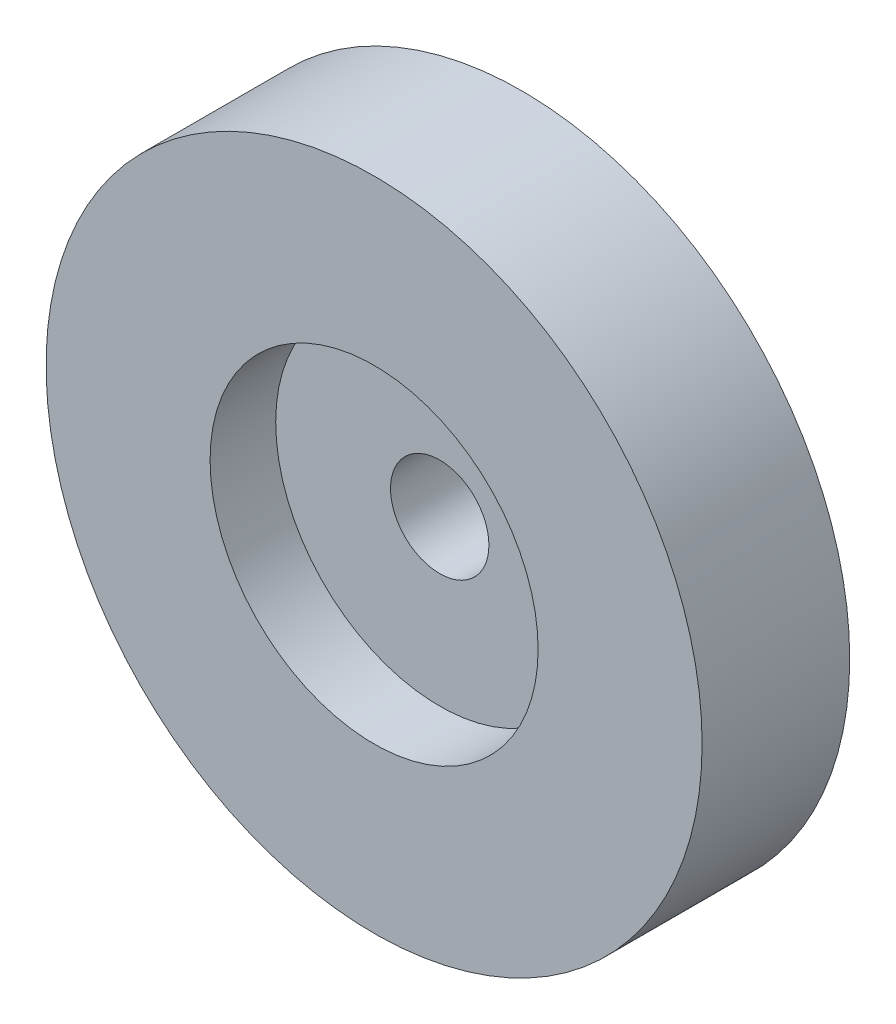
ISO-10303-21;
HEADER;
FILE_DESCRIPTION(('STEP AP214'),'2;1');
FILE_NAME('part.step','',(''),(''),'','','');
FILE_SCHEMA(('AUTOMOTIVE_DESIGN { 1 0 10303 214 1 1 1 1 }'));
ENDSEC;
DATA;
#1=APPLICATION_CONTEXT('core data for automotive mechanical design processes');
#2=APPLICATION_PROTOCOL_DEFINITION('international standard','automotive_design',2000,#1);
#3=PRODUCT_CONTEXT('',#1,'mechanical');
#4=PRODUCT('Part','Part','',(#3));
#5=PRODUCT_RELATED_PRODUCT_CATEGORY('part','',(#4));
#6=PRODUCT_DEFINITION_FORMATION('','',#4);
#7=PRODUCT_DEFINITION_CONTEXT('part definition',#1,'design');
#8=PRODUCT_DEFINITION('design','',#6,#7);
#9=PRODUCT_DEFINITION_SHAPE('','',#8);
#10=(LENGTH_UNIT() NAMED_UNIT(*) SI_UNIT(.MILLI.,.METRE.));
#11=(NAMED_UNIT(*) PLANE_ANGLE_UNIT() SI_UNIT($,.RADIAN.));
#12=(NAMED_UNIT(*) SI_UNIT($,.STERADIAN.) SOLID_ANGLE_UNIT());
#13=UNCERTAINTY_MEASURE_WITH_UNIT(LENGTH_MEASURE(1.E-05),#10,'distance_accuracy_value','');
#14=(GEOMETRIC_REPRESENTATION_CONTEXT(3) GLOBAL_UNCERTAINTY_ASSIGNED_CONTEXT((#13)) GLOBAL_UNIT_ASSIGNED_CONTEXT((#10,
#11,#12)) REPRESENTATION_CONTEXT('',''));
#15=CARTESIAN_POINT('',(0.,0.,0.));
#16=DIRECTION('',(0.,0.,1.));
#17=DIRECTION('',(1.,0.,0.));
#18=AXIS2_PLACEMENT_3D('',#15,#16,#17);
#19=CARTESIAN_POINT('',(0.,0.,0.));
#20=DIRECTION('',(0.,0.,1.));
#21=DIRECTION('',(1.,0.,0.));
#22=AXIS2_PLACEMENT_3D('',#19,#20,#21);
#23=CYLINDRICAL_SURFACE('',#22,6.);
#24=CARTESIAN_POINT('',(0.,0.,-18.));
#25=DIRECTION('',(0.,0.,1.));
#26=DIRECTION('',(1.,0.,0.));
#27=AXIS2_PLACEMENT_3D('',#24,#25,#26);
#28=CIRCLE('',#27,6.);
#29=CARTESIAN_POINT('',(6.,0.,-18.));
#30=VERTEX_POINT('',#29);
#31=EDGE_CURVE('E59',#30,#30,#28,.T.);
#32=ORIENTED_EDGE('',*,*,#31,.F.);
#33=EDGE_LOOP('',(#32));
#34=FACE_BOUND('',#33,.T.);
#35=CARTESIAN_POINT('',(0.,0.,-8.));
#36=DIRECTION('',(0.,0.,1.));
#37=DIRECTION('',(1.,0.,0.));
#38=AXIS2_PLACEMENT_3D('',#35,#36,#37);
#39=CIRCLE('',#38,6.);
#40=CARTESIAN_POINT('',(6.,0.,-8.));
#41=VERTEX_POINT('',#40);
#42=EDGE_CURVE('E10',#41,#41,#39,.T.);
#43=ORIENTED_EDGE('',*,*,#42,.T.);
#44=EDGE_LOOP('',(#43));
#45=FACE_BOUND('',#44,.T.);
#46=ADVANCED_FACE('F37',(#34,#45),#23,.F.);
#47=CARTESIAN_POINT('',(0.,0.,-8.));
#48=DIRECTION('',(0.,0.,1.));
#49=DIRECTION('',(1.,0.,0.));
#50=AXIS2_PLACEMENT_3D('',#47,#48,#49);
#51=PLANE('',#50);
#52=CARTESIAN_POINT('',(0.,0.,-8.));
#53=DIRECTION('',(0.,0.,1.));
#54=DIRECTION('',(1.,0.,0.));
#55=AXIS2_PLACEMENT_3D('',#52,#53,#54);
#56=CIRCLE('',#55,20.);
#57=CARTESIAN_POINT('',(20.,0.,-8.));
#58=VERTEX_POINT('',#57);
#59=EDGE_CURVE('E43',#58,#58,#56,.T.);
#60=ORIENTED_EDGE('',*,*,#59,.T.);
#61=EDGE_LOOP('',(#60));
#62=FACE_BOUND('',#61,.T.);
#63=ORIENTED_EDGE('',*,*,#42,.F.);
#64=EDGE_LOOP('',(#63));
#65=FACE_BOUND('',#64,.T.);
#66=ADVANCED_FACE('F66',(#62,#65),#51,.T.);
#67=CARTESIAN_POINT('',(0.,0.,0.));
#68=DIRECTION('',(0.,0.,1.));
#69=DIRECTION('',(1.,0.,0.));
#70=AXIS2_PLACEMENT_3D('',#67,#68,#69);
#71=CYLINDRICAL_SURFACE('',#70,20.);
#72=ORIENTED_EDGE('',*,*,#59,.F.);
#73=EDGE_LOOP('',(#72));
#74=FACE_BOUND('',#73,.T.);
#75=CARTESIAN_POINT('',(0.,0.,0.));
#76=DIRECTION('',(0.,0.,1.));
#77=DIRECTION('',(1.,0.,0.));
#78=AXIS2_PLACEMENT_3D('',#75,#76,#77);
#79=CIRCLE('',#78,20.);
#80=CARTESIAN_POINT('',(20.,0.,0.));
#81=VERTEX_POINT('',#80);
#82=EDGE_CURVE('E47',#81,#81,#79,.T.);
#83=ORIENTED_EDGE('',*,*,#82,.T.);
#84=EDGE_LOOP('',(#83));
#85=FACE_BOUND('',#84,.T.);
#86=ADVANCED_FACE('F70',(#74,#85),#71,.F.);
#87=CARTESIAN_POINT('',(0.,0.,0.));
#88=DIRECTION('',(0.,0.,1.));
#89=DIRECTION('',(1.,0.,0.));
#90=AXIS2_PLACEMENT_3D('',#87,#88,#89);
#91=PLANE('',#90);
#92=CARTESIAN_POINT('',(0.,0.,0.));
#93=DIRECTION('',(0.,0.,1.));
#94=DIRECTION('',(1.,0.,0.));
#95=AXIS2_PLACEMENT_3D('',#92,#93,#94);
#96=CIRCLE('',#95,40.);
#97=CARTESIAN_POINT('',(40.,0.,0.));
#98=VERTEX_POINT('',#97);
#99=EDGE_CURVE('E51',#98,#98,#96,.T.);
#100=ORIENTED_EDGE('',*,*,#99,.T.);
#101=EDGE_LOOP('',(#100));
#102=FACE_BOUND('',#101,.T.);
#103=ORIENTED_EDGE('',*,*,#82,.F.);
#104=EDGE_LOOP('',(#103));
#105=FACE_BOUND('',#104,.T.);
#106=ADVANCED_FACE('F74',(#102,#105),#91,.T.);
#107=CARTESIAN_POINT('',(0.,0.,0.));
#108=DIRECTION('',(0.,0.,1.));
#109=DIRECTION('',(1.,0.,0.));
#110=AXIS2_PLACEMENT_3D('',#107,#108,#109);
#111=CYLINDRICAL_SURFACE('',#110,40.);
#112=CARTESIAN_POINT('',(0.,0.,-18.));
#113=DIRECTION('',(0.,0.,1.));
#114=DIRECTION('',(1.,0.,0.));
#115=AXIS2_PLACEMENT_3D('',#112,#113,#114);
#116=CIRCLE('',#115,40.);
#117=CARTESIAN_POINT('',(40.,0.,-18.));
#118=VERTEX_POINT('',#117);
#119=EDGE_CURVE('E56',#118,#118,#116,.T.);
#120=ORIENTED_EDGE('',*,*,#119,.T.);
#121=EDGE_LOOP('',(#120));
#122=FACE_BOUND('',#121,.T.);
#123=ORIENTED_EDGE('',*,*,#99,.F.);
#124=EDGE_LOOP('',(#123));
#125=FACE_BOUND('',#124,.T.);
#126=ADVANCED_FACE('F81',(#122,#125),#111,.T.);
#127=CARTESIAN_POINT('',(0.,0.,-18.));
#128=DIRECTION('',(0.,0.,1.));
#129=DIRECTION('',(1.,0.,0.));
#130=AXIS2_PLACEMENT_3D('',#127,#128,#129);
#131=PLANE('',#130);
#132=ORIENTED_EDGE('',*,*,#119,.F.);
#133=EDGE_LOOP('',(#132));
#134=FACE_BOUND('',#133,.T.);
#135=ORIENTED_EDGE('',*,*,#31,.T.);
#136=EDGE_LOOP('',(#135));
#137=FACE_BOUND('',#136,.T.);
#138=ADVANCED_FACE('F63',(#134,#137),#131,.F.);
#139=CLOSED_SHELL('',(#46,#66,#86,#106,#126,#138));
#140=MANIFOLD_SOLID_BREP('B2',#139);
#141=ADVANCED_BREP_SHAPE_REPRESENTATION('',(#18,#140),#14);
#142=SHAPE_DEFINITION_REPRESENTATION(#9,#141);
ENDSEC;
END-ISO-10303-21;
